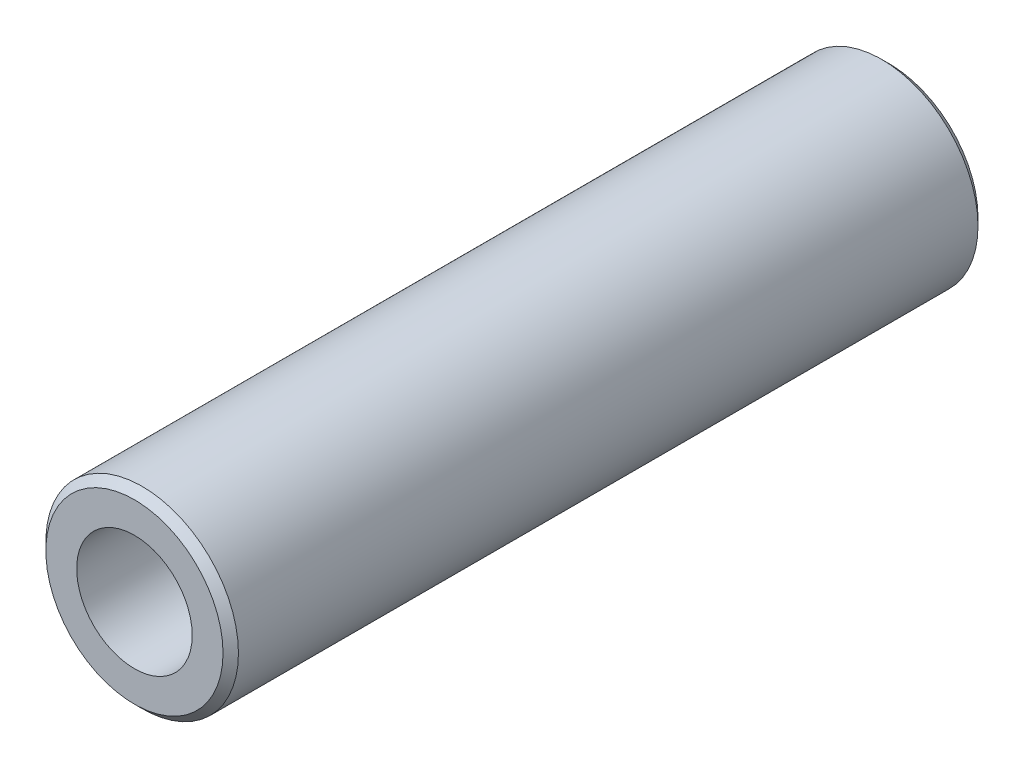
ISO-10303-21;
HEADER;
FILE_DESCRIPTION(('STEP AP214'),'2;1');
FILE_NAME('part.step','',(''),(''),'','','');
FILE_SCHEMA(('AUTOMOTIVE_DESIGN { 1 0 10303 214 1 1 1 1 }'));
ENDSEC;
DATA;
#1=APPLICATION_CONTEXT('core data for automotive mechanical design processes');
#2=APPLICATION_PROTOCOL_DEFINITION('international standard','automotive_design',2000,#1);
#3=PRODUCT_CONTEXT('',#1,'mechanical');
#4=PRODUCT('Part','Part','',(#3));
#5=PRODUCT_RELATED_PRODUCT_CATEGORY('part','',(#4));
#6=PRODUCT_DEFINITION_FORMATION('','',#4);
#7=PRODUCT_DEFINITION_CONTEXT('part definition',#1,'design');
#8=PRODUCT_DEFINITION('design','',#6,#7);
#9=PRODUCT_DEFINITION_SHAPE('','',#8);
#10=(LENGTH_UNIT() NAMED_UNIT(*) SI_UNIT(.MILLI.,.METRE.));
#11=(NAMED_UNIT(*) PLANE_ANGLE_UNIT() SI_UNIT($,.RADIAN.));
#12=(NAMED_UNIT(*) SI_UNIT($,.STERADIAN.) SOLID_ANGLE_UNIT());
#13=UNCERTAINTY_MEASURE_WITH_UNIT(LENGTH_MEASURE(1.E-05),#10,'distance_accuracy_value','');
#14=(GEOMETRIC_REPRESENTATION_CONTEXT(3) GLOBAL_UNCERTAINTY_ASSIGNED_CONTEXT((#13)) GLOBAL_UNIT_ASSIGNED_CONTEXT((#10,
#11,#12)) REPRESENTATION_CONTEXT('',''));
#15=CARTESIAN_POINT('',(0.,0.,0.));
#16=DIRECTION('',(0.,0.,1.));
#17=DIRECTION('',(1.,0.,0.));
#18=AXIS2_PLACEMENT_3D('',#15,#16,#17);
#19=CARTESIAN_POINT('',(0.,0.,1244.6));
#20=DIRECTION('',(0.,0.,1.));
#21=DIRECTION('',(1.,0.,0.));
#22=AXIS2_PLACEMENT_3D('',#19,#20,#21);
#23=PLANE('',#22);
#24=CARTESIAN_POINT('',(0.,0.,1244.6));
#25=DIRECTION('',(0.,0.,1.));
#26=DIRECTION('',(1.,0.,0.));
#27=AXIS2_PLACEMENT_3D('',#24,#25,#26);
#28=CIRCLE('',#27,146.05);
#29=CARTESIAN_POINT('',(146.05,0.,1244.6));
#30=VERTEX_POINT('',#29);
#31=EDGE_CURVE('E11',#30,#30,#28,.T.);
#32=ORIENTED_EDGE('',*,*,#31,.T.);
#33=EDGE_LOOP('',(#32));
#34=FACE_BOUND('',#33,.T.);
#35=CARTESIAN_POINT('',(0.,0.,1244.6));
#36=DIRECTION('',(0.,0.,1.));
#37=DIRECTION('',(1.,0.,0.));
#38=AXIS2_PLACEMENT_3D('',#35,#36,#37);
#39=CIRCLE('',#38,95.25);
#40=CARTESIAN_POINT('',(95.25,0.,1244.6));
#41=VERTEX_POINT('',#40);
#42=EDGE_CURVE('E63',#41,#41,#39,.T.);
#43=ORIENTED_EDGE('',*,*,#42,.F.);
#44=EDGE_LOOP('',(#43));
#45=FACE_BOUND('',#44,.T.);
#46=ADVANCED_FACE('F42',(#34,#45),#23,.T.);
#47=CARTESIAN_POINT('',(0.,0.,0.));
#48=DIRECTION('',(0.,0.,1.));
#49=DIRECTION('',(1.,0.,0.));
#50=AXIS2_PLACEMENT_3D('',#47,#48,#49);
#51=PLANE('',#50);
#52=CARTESIAN_POINT('',(0.,0.,0.));
#53=DIRECTION('',(0.,0.,1.));
#54=DIRECTION('',(1.,0.,0.));
#55=AXIS2_PLACEMENT_3D('',#52,#53,#54);
#56=CIRCLE('',#55,146.05);
#57=CARTESIAN_POINT('',(146.05,0.,0.));
#58=VERTEX_POINT('',#57);
#59=EDGE_CURVE('E50',#58,#58,#56,.F.);
#60=ORIENTED_EDGE('',*,*,#59,.T.);
#61=EDGE_LOOP('',(#60));
#62=FACE_BOUND('',#61,.T.);
#63=CARTESIAN_POINT('',(0.,0.,0.));
#64=DIRECTION('',(0.,0.,1.));
#65=DIRECTION('',(1.,0.,0.));
#66=AXIS2_PLACEMENT_3D('',#63,#64,#65);
#67=CIRCLE('',#66,95.25);
#68=CARTESIAN_POINT('',(95.25,0.,0.));
#69=VERTEX_POINT('',#68);
#70=EDGE_CURVE('E64',#69,#69,#67,.T.);
#71=ORIENTED_EDGE('',*,*,#70,.T.);
#72=EDGE_LOOP('',(#71));
#73=FACE_BOUND('',#72,.T.);
#74=ADVANCED_FACE('F74',(#62,#73),#51,.F.);
#75=CARTESIAN_POINT('',(0.,0.,1244.6));
#76=DIRECTION('',(0.,0.,-1.));
#77=DIRECTION('',(-1.,0.,0.));
#78=AXIS2_PLACEMENT_3D('',#75,#76,#77);
#79=CYLINDRICAL_SURFACE('',#78,158.75);
#80=CARTESIAN_POINT('',(0.,0.,12.6999999999997));
#81=DIRECTION('',(0.,0.,1.));
#82=DIRECTION('',(1.,0.,0.));
#83=AXIS2_PLACEMENT_3D('',#80,#81,#82);
#84=CIRCLE('',#83,158.75);
#85=CARTESIAN_POINT('',(158.75,0.,12.6999999999997));
#86=VERTEX_POINT('',#85);
#87=EDGE_CURVE('E54',#86,#86,#84,.T.);
#88=ORIENTED_EDGE('',*,*,#87,.T.);
#89=EDGE_LOOP('',(#88));
#90=FACE_BOUND('',#89,.T.);
#91=CARTESIAN_POINT('',(0.,0.,1231.9));
#92=DIRECTION('',(0.,0.,1.));
#93=DIRECTION('',(1.,0.,0.));
#94=AXIS2_PLACEMENT_3D('',#91,#92,#93);
#95=CIRCLE('',#94,158.75);
#96=CARTESIAN_POINT('',(158.75,0.,1231.9));
#97=VERTEX_POINT('',#96);
#98=EDGE_CURVE('E58',#97,#97,#95,.F.);
#99=ORIENTED_EDGE('',*,*,#98,.T.);
#100=EDGE_LOOP('',(#99));
#101=FACE_BOUND('',#100,.T.);
#102=ADVANCED_FACE('F79',(#90,#101),#79,.T.);
#103=CARTESIAN_POINT('',(0.,0.,1244.6));
#104=DIRECTION('',(0.,0.,-1.));
#105=DIRECTION('',(-1.,0.,0.));
#106=AXIS2_PLACEMENT_3D('',#103,#104,#105);
#107=CYLINDRICAL_SURFACE('',#106,95.25);
#108=ORIENTED_EDGE('',*,*,#42,.T.);
#109=EDGE_LOOP('',(#108));
#110=FACE_BOUND('',#109,.T.);
#111=ORIENTED_EDGE('',*,*,#70,.F.);
#112=EDGE_LOOP('',(#111));
#113=FACE_BOUND('',#112,.T.);
#114=ADVANCED_FACE('F70',(#110,#113),#107,.F.);
#115=CARTESIAN_POINT('',(0.,0.,12.6999999999997));
#116=DIRECTION('',(0.,0.,1.));
#117=DIRECTION('',(1.,0.,0.));
#118=AXIS2_PLACEMENT_3D('',#115,#116,#117);
#119=CONICAL_SURFACE('',#118,158.75,0.78539816339745);
#120=ORIENTED_EDGE('',*,*,#59,.F.);
#121=EDGE_LOOP('',(#120));
#122=FACE_BOUND('',#121,.T.);
#123=ORIENTED_EDGE('',*,*,#87,.F.);
#124=EDGE_LOOP('',(#123));
#125=FACE_BOUND('',#124,.T.);
#126=ADVANCED_FACE('F86',(#122,#125),#119,.T.);
#127=CARTESIAN_POINT('',(0.,0.,1244.6));
#128=DIRECTION('',(0.,0.,-1.));
#129=DIRECTION('',(-1.,0.,0.));
#130=AXIS2_PLACEMENT_3D('',#127,#128,#129);
#131=CONICAL_SURFACE('',#130,146.05,0.78539816339745);
#132=ORIENTED_EDGE('',*,*,#98,.F.);
#133=EDGE_LOOP('',(#132));
#134=FACE_BOUND('',#133,.T.);
#135=ORIENTED_EDGE('',*,*,#31,.F.);
#136=EDGE_LOOP('',(#135));
#137=FACE_BOUND('',#136,.T.);
#138=ADVANCED_FACE('F45',(#134,#137),#131,.T.);
#139=CLOSED_SHELL('',(#46,#74,#102,#114,#126,#138));
#140=MANIFOLD_SOLID_BREP('B2',#139);
#141=ADVANCED_BREP_SHAPE_REPRESENTATION('',(#18,#140),#14);
#142=SHAPE_DEFINITION_REPRESENTATION(#9,#141);
ENDSEC;
END-ISO-10303-21;
